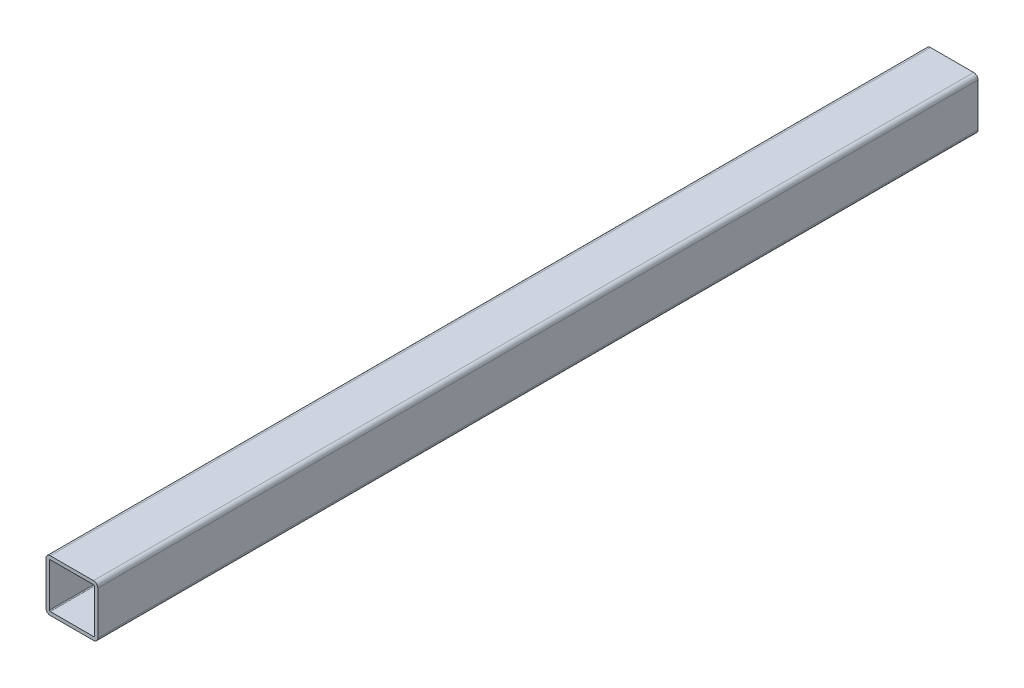
ISO-10303-21;
HEADER;
FILE_DESCRIPTION(('STEP AP214'),'2;1');
FILE_NAME('part.step','',(''),(''),'','','');
FILE_SCHEMA(('AUTOMOTIVE_DESIGN { 1 0 10303 214 1 1 1 1 }'));
ENDSEC;
DATA;
#1=APPLICATION_CONTEXT('core data for automotive mechanical design processes');
#2=APPLICATION_PROTOCOL_DEFINITION('international standard','automotive_design',2000,#1);
#3=PRODUCT_CONTEXT('',#1,'mechanical');
#4=PRODUCT('Part','Part','',(#3));
#5=PRODUCT_RELATED_PRODUCT_CATEGORY('part','',(#4));
#6=PRODUCT_DEFINITION_FORMATION('','',#4);
#7=PRODUCT_DEFINITION_CONTEXT('part definition',#1,'design');
#8=PRODUCT_DEFINITION('design','',#6,#7);
#9=PRODUCT_DEFINITION_SHAPE('','',#8);
#10=(LENGTH_UNIT() NAMED_UNIT(*) SI_UNIT(.MILLI.,.METRE.));
#11=(NAMED_UNIT(*) PLANE_ANGLE_UNIT() SI_UNIT($,.RADIAN.));
#12=(NAMED_UNIT(*) SI_UNIT($,.STERADIAN.) SOLID_ANGLE_UNIT());
#13=UNCERTAINTY_MEASURE_WITH_UNIT(LENGTH_MEASURE(1.E-05),#10,'distance_accuracy_value','');
#14=(GEOMETRIC_REPRESENTATION_CONTEXT(3) GLOBAL_UNCERTAINTY_ASSIGNED_CONTEXT((#13)) GLOBAL_UNIT_ASSIGNED_CONTEXT((#10,
#11,#12)) REPRESENTATION_CONTEXT('',''));
#15=CARTESIAN_POINT('',(0.,0.,0.));
#16=DIRECTION('',(0.,0.,1.));
#17=DIRECTION('',(1.,0.,0.));
#18=AXIS2_PLACEMENT_3D('',#15,#16,#17);
#19=CARTESIAN_POINT('',(-15.875,-15.875,323.85));
#20=DIRECTION('',(0.,0.,1.));
#21=DIRECTION('',(1.,0.,0.));
#22=AXIS2_PLACEMENT_3D('',#19,#20,#21);
#23=PLANE('',#22);
#24=CARTESIAN_POINT('',(-15.875,-15.875,323.85));
#25=DIRECTION('',(0.,0.,1.));
#26=DIRECTION('',(1.,0.,0.));
#27=AXIS2_PLACEMENT_3D('',#24,#25,#26);
#28=CIRCLE('',#27,3.175);
#29=CARTESIAN_POINT('',(-19.05,-15.875,323.85));
#30=VERTEX_POINT('',#29);
#31=CARTESIAN_POINT('',(-15.875,-19.05,323.85));
#32=VERTEX_POINT('',#31);
#33=EDGE_CURVE('E259',#30,#32,#28,.T.);
#34=ORIENTED_EDGE('',*,*,#33,.T.);
#35=DIRECTION('',(1.,0.,0.));
#36=VECTOR('',#35,1.);
#37=CARTESIAN_POINT('',(-15.875,-19.05,323.85));
#38=LINE('',#37,#36);
#39=CARTESIAN_POINT('',(15.875,-19.05,323.85));
#40=VERTEX_POINT('',#39);
#41=EDGE_CURVE('E262',#32,#40,#38,.T.);
#42=ORIENTED_EDGE('',*,*,#41,.T.);
#43=CARTESIAN_POINT('',(15.875,-15.875,323.85));
#44=DIRECTION('',(0.,0.,1.));
#45=DIRECTION('',(1.,0.,0.));
#46=AXIS2_PLACEMENT_3D('',#43,#44,#45);
#47=CIRCLE('',#46,3.175);
#48=CARTESIAN_POINT('',(19.05,-15.875,323.85));
#49=VERTEX_POINT('',#48);
#50=EDGE_CURVE('E265',#40,#49,#47,.T.);
#51=ORIENTED_EDGE('',*,*,#50,.T.);
#52=DIRECTION('',(0.,1.,0.));
#53=VECTOR('',#52,1.);
#54=CARTESIAN_POINT('',(19.05,15.875,323.85));
#55=LINE('',#54,#53);
#56=CARTESIAN_POINT('',(19.05,15.875,323.85));
#57=VERTEX_POINT('',#56);
#58=EDGE_CURVE('E267',#49,#57,#55,.T.);
#59=ORIENTED_EDGE('',*,*,#58,.T.);
#60=CARTESIAN_POINT('',(15.875,15.875,323.85));
#61=DIRECTION('',(0.,0.,1.));
#62=DIRECTION('',(1.,0.,0.));
#63=AXIS2_PLACEMENT_3D('',#60,#61,#62);
#64=CIRCLE('',#63,3.175);
#65=CARTESIAN_POINT('',(15.875,19.05,323.85));
#66=VERTEX_POINT('',#65);
#67=EDGE_CURVE('E269',#57,#66,#64,.T.);
#68=ORIENTED_EDGE('',*,*,#67,.T.);
#69=DIRECTION('',(-1.,0.,0.));
#70=VECTOR('',#69,1.);
#71=CARTESIAN_POINT('',(-15.875,19.05,323.85));
#72=LINE('',#71,#70);
#73=CARTESIAN_POINT('',(-15.875,19.05,323.85));
#74=VERTEX_POINT('',#73);
#75=EDGE_CURVE('E271',#66,#74,#72,.T.);
#76=ORIENTED_EDGE('',*,*,#75,.T.);
#77=CARTESIAN_POINT('',(-15.875,15.875,323.85));
#78=DIRECTION('',(0.,0.,1.));
#79=DIRECTION('',(1.,0.,0.));
#80=AXIS2_PLACEMENT_3D('',#77,#78,#79);
#81=CIRCLE('',#80,3.175);
#82=CARTESIAN_POINT('',(-19.05,15.875,323.85));
#83=VERTEX_POINT('',#82);
#84=EDGE_CURVE('E273',#74,#83,#81,.T.);
#85=ORIENTED_EDGE('',*,*,#84,.T.);
#86=DIRECTION('',(0.,-1.,0.));
#87=VECTOR('',#86,1.);
#88=CARTESIAN_POINT('',(-19.05,15.875,323.85));
#89=LINE('',#88,#87);
#90=EDGE_CURVE('E275',#83,#30,#89,.T.);
#91=ORIENTED_EDGE('',*,*,#90,.T.);
#92=EDGE_LOOP('',(#34,#42,#51,#59,#68,#76,#85,#91));
#93=FACE_BOUND('',#92,.T.);
#94=DIRECTION('',(1.,0.,0.));
#95=VECTOR('',#94,1.);
#96=CARTESIAN_POINT('',(-15.875,-16.51,323.85));
#97=LINE('',#96,#95);
#98=CARTESIAN_POINT('',(-15.875,-16.51,323.85));
#99=VERTEX_POINT('',#98);
#100=CARTESIAN_POINT('',(15.875,-16.51,323.85));
#101=VERTEX_POINT('',#100);
#102=EDGE_CURVE('E202',#99,#101,#97,.T.);
#103=ORIENTED_EDGE('',*,*,#102,.F.);
#104=CARTESIAN_POINT('',(-15.875,-15.875,323.85));
#105=DIRECTION('',(0.,0.,1.));
#106=DIRECTION('',(1.,0.,0.));
#107=AXIS2_PLACEMENT_3D('',#104,#105,#106);
#108=CIRCLE('',#107,0.635000000000002);
#109=CARTESIAN_POINT('',(-16.51,-15.875,323.85));
#110=VERTEX_POINT('',#109);
#111=EDGE_CURVE('E194',#110,#99,#108,.T.);
#112=ORIENTED_EDGE('',*,*,#111,.F.);
#113=DIRECTION('',(0.,-1.,0.));
#114=VECTOR('',#113,1.);
#115=CARTESIAN_POINT('',(-16.51,15.875,323.85));
#116=LINE('',#115,#114);
#117=CARTESIAN_POINT('',(-16.51,15.875,323.85));
#118=VERTEX_POINT('',#117);
#119=EDGE_CURVE('E227',#118,#110,#116,.T.);
#120=ORIENTED_EDGE('',*,*,#119,.F.);
#121=CARTESIAN_POINT('',(-15.875,15.875,323.85));
#122=DIRECTION('',(0.,0.,1.));
#123=DIRECTION('',(1.,0.,0.));
#124=AXIS2_PLACEMENT_3D('',#121,#122,#123);
#125=CIRCLE('',#124,0.635000000000004);
#126=CARTESIAN_POINT('',(-15.875,16.51,323.85));
#127=VERTEX_POINT('',#126);
#128=EDGE_CURVE('E225',#127,#118,#125,.T.);
#129=ORIENTED_EDGE('',*,*,#128,.F.);
#130=DIRECTION('',(-1.,0.,0.));
#131=VECTOR('',#130,1.);
#132=CARTESIAN_POINT('',(-15.875,16.51,323.85));
#133=LINE('',#132,#131);
#134=CARTESIAN_POINT('',(15.875,16.51,323.85));
#135=VERTEX_POINT('',#134);
#136=EDGE_CURVE('E223',#135,#127,#133,.T.);
#137=ORIENTED_EDGE('',*,*,#136,.F.);
#138=CARTESIAN_POINT('',(15.875,15.875,323.85));
#139=DIRECTION('',(0.,0.,1.));
#140=DIRECTION('',(1.,0.,0.));
#141=AXIS2_PLACEMENT_3D('',#138,#139,#140);
#142=CIRCLE('',#141,0.635000000000004);
#143=CARTESIAN_POINT('',(16.51,15.875,323.85));
#144=VERTEX_POINT('',#143);
#145=EDGE_CURVE('E221',#144,#135,#142,.T.);
#146=ORIENTED_EDGE('',*,*,#145,.F.);
#147=DIRECTION('',(0.,1.,0.));
#148=VECTOR('',#147,1.);
#149=CARTESIAN_POINT('',(16.51,15.875,323.85));
#150=LINE('',#149,#148);
#151=CARTESIAN_POINT('',(16.51,-15.875,323.85));
#152=VERTEX_POINT('',#151);
#153=EDGE_CURVE('E217',#152,#144,#150,.T.);
#154=ORIENTED_EDGE('',*,*,#153,.F.);
#155=CARTESIAN_POINT('',(15.875,-15.875,323.85));
#156=DIRECTION('',(0.,0.,1.));
#157=DIRECTION('',(1.,0.,0.));
#158=AXIS2_PLACEMENT_3D('',#155,#156,#157);
#159=CIRCLE('',#158,0.634999999999999);
#160=EDGE_CURVE('E215',#101,#152,#159,.T.);
#161=ORIENTED_EDGE('',*,*,#160,.F.);
#162=EDGE_LOOP('',(#103,#112,#120,#129,#137,#146,#154,#161));
#163=FACE_BOUND('',#162,.T.);
#164=ADVANCED_FACE('F81',(#93,#163),#23,.T.);
#165=CARTESIAN_POINT('',(-15.875,-15.875,-323.85));
#166=DIRECTION('',(0.,0.,1.));
#167=DIRECTION('',(1.,0.,0.));
#168=AXIS2_PLACEMENT_3D('',#165,#166,#167);
#169=PLANE('',#168);
#170=CARTESIAN_POINT('',(-15.875,-15.875,-323.85));
#171=DIRECTION('',(0.,0.,1.));
#172=DIRECTION('',(1.,0.,0.));
#173=AXIS2_PLACEMENT_3D('',#170,#171,#172);
#174=CIRCLE('',#173,3.175);
#175=CARTESIAN_POINT('',(-19.05,-15.875,-323.85));
#176=VERTEX_POINT('',#175);
#177=CARTESIAN_POINT('',(-15.875,-19.05,-323.85));
#178=VERTEX_POINT('',#177);
#179=EDGE_CURVE('E210',#176,#178,#174,.T.);
#180=ORIENTED_EDGE('',*,*,#179,.F.);
#181=DIRECTION('',(0.,-1.,0.));
#182=VECTOR('',#181,1.);
#183=CARTESIAN_POINT('',(-19.05,15.875,-323.85));
#184=LINE('',#183,#182);
#185=CARTESIAN_POINT('',(-19.05,15.875,-323.85));
#186=VERTEX_POINT('',#185);
#187=EDGE_CURVE('E263',#186,#176,#184,.T.);
#188=ORIENTED_EDGE('',*,*,#187,.F.);
#189=CARTESIAN_POINT('',(-15.875,15.875,-323.85));
#190=DIRECTION('',(0.,0.,1.));
#191=DIRECTION('',(1.,0.,0.));
#192=AXIS2_PLACEMENT_3D('',#189,#190,#191);
#193=CIRCLE('',#192,3.175);
#194=CARTESIAN_POINT('',(-15.875,19.05,-323.85));
#195=VERTEX_POINT('',#194);
#196=EDGE_CURVE('E290',#195,#186,#193,.T.);
#197=ORIENTED_EDGE('',*,*,#196,.F.);
#198=DIRECTION('',(-1.,0.,0.));
#199=VECTOR('',#198,1.);
#200=CARTESIAN_POINT('',(-15.875,19.05,-323.85));
#201=LINE('',#200,#199);
#202=CARTESIAN_POINT('',(15.875,19.05,-323.85));
#203=VERTEX_POINT('',#202);
#204=EDGE_CURVE('E288',#203,#195,#201,.T.);
#205=ORIENTED_EDGE('',*,*,#204,.F.);
#206=CARTESIAN_POINT('',(15.875,15.875,-323.85));
#207=DIRECTION('',(0.,0.,1.));
#208=DIRECTION('',(1.,0.,0.));
#209=AXIS2_PLACEMENT_3D('',#206,#207,#208);
#210=CIRCLE('',#209,3.175);
#211=CARTESIAN_POINT('',(19.05,15.875,-323.85));
#212=VERTEX_POINT('',#211);
#213=EDGE_CURVE('E286',#212,#203,#210,.T.);
#214=ORIENTED_EDGE('',*,*,#213,.F.);
#215=DIRECTION('',(0.,1.,0.));
#216=VECTOR('',#215,1.);
#217=CARTESIAN_POINT('',(19.05,15.875,-323.85));
#218=LINE('',#217,#216);
#219=CARTESIAN_POINT('',(19.05,-15.875,-323.85));
#220=VERTEX_POINT('',#219);
#221=EDGE_CURVE('E284',#220,#212,#218,.T.);
#222=ORIENTED_EDGE('',*,*,#221,.F.);
#223=CARTESIAN_POINT('',(15.875,-15.875,-323.85));
#224=DIRECTION('',(0.,0.,1.));
#225=DIRECTION('',(1.,0.,0.));
#226=AXIS2_PLACEMENT_3D('',#223,#224,#225);
#227=CIRCLE('',#226,3.175);
#228=CARTESIAN_POINT('',(15.875,-19.05,-323.85));
#229=VERTEX_POINT('',#228);
#230=EDGE_CURVE('E282',#229,#220,#227,.T.);
#231=ORIENTED_EDGE('',*,*,#230,.F.);
#232=DIRECTION('',(1.,0.,0.));
#233=VECTOR('',#232,1.);
#234=CARTESIAN_POINT('',(-15.875,-19.05,-323.85));
#235=LINE('',#234,#233);
#236=EDGE_CURVE('E280',#178,#229,#235,.T.);
#237=ORIENTED_EDGE('',*,*,#236,.F.);
#238=EDGE_LOOP('',(#180,#188,#197,#205,#214,#222,#231,#237));
#239=FACE_BOUND('',#238,.T.);
#240=CARTESIAN_POINT('',(-15.875,-15.875,-323.85));
#241=DIRECTION('',(0.,0.,1.));
#242=DIRECTION('',(1.,0.,0.));
#243=AXIS2_PLACEMENT_3D('',#240,#241,#242);
#244=CIRCLE('',#243,0.635000000000002);
#245=CARTESIAN_POINT('',(-16.51,-15.875,-323.85));
#246=VERTEX_POINT('',#245);
#247=CARTESIAN_POINT('',(-15.875,-16.51,-323.85));
#248=VERTEX_POINT('',#247);
#249=EDGE_CURVE('E104',#246,#248,#244,.T.);
#250=ORIENTED_EDGE('',*,*,#249,.T.);
#251=DIRECTION('',(1.,0.,0.));
#252=VECTOR('',#251,1.);
#253=CARTESIAN_POINT('',(-15.875,-16.51,-323.85));
#254=LINE('',#253,#252);
#255=CARTESIAN_POINT('',(15.875,-16.51,-323.85));
#256=VERTEX_POINT('',#255);
#257=EDGE_CURVE('E209',#248,#256,#254,.T.);
#258=ORIENTED_EDGE('',*,*,#257,.T.);
#259=CARTESIAN_POINT('',(15.875,-15.875,-323.85));
#260=DIRECTION('',(0.,0.,1.));
#261=DIRECTION('',(1.,0.,0.));
#262=AXIS2_PLACEMENT_3D('',#259,#260,#261);
#263=CIRCLE('',#262,0.634999999999999);
#264=CARTESIAN_POINT('',(16.51,-15.875,-323.85));
#265=VERTEX_POINT('',#264);
#266=EDGE_CURVE('E231',#256,#265,#263,.T.);
#267=ORIENTED_EDGE('',*,*,#266,.T.);
#268=DIRECTION('',(0.,1.,0.));
#269=VECTOR('',#268,1.);
#270=CARTESIAN_POINT('',(16.51,15.875,-323.85));
#271=LINE('',#270,#269);
#272=CARTESIAN_POINT('',(16.51,15.875,-323.85));
#273=VERTEX_POINT('',#272);
#274=EDGE_CURVE('E234',#265,#273,#271,.T.);
#275=ORIENTED_EDGE('',*,*,#274,.T.);
#276=CARTESIAN_POINT('',(15.875,15.875,-323.85));
#277=DIRECTION('',(0.,0.,1.));
#278=DIRECTION('',(1.,0.,0.));
#279=AXIS2_PLACEMENT_3D('',#276,#277,#278);
#280=CIRCLE('',#279,0.635000000000004);
#281=CARTESIAN_POINT('',(15.875,16.51,-323.85));
#282=VERTEX_POINT('',#281);
#283=EDGE_CURVE('E237',#273,#282,#280,.T.);
#284=ORIENTED_EDGE('',*,*,#283,.T.);
#285=DIRECTION('',(-1.,0.,0.));
#286=VECTOR('',#285,1.);
#287=CARTESIAN_POINT('',(-15.875,16.51,-323.85));
#288=LINE('',#287,#286);
#289=CARTESIAN_POINT('',(-15.875,16.51,-323.85));
#290=VERTEX_POINT('',#289);
#291=EDGE_CURVE('E240',#282,#290,#288,.T.);
#292=ORIENTED_EDGE('',*,*,#291,.T.);
#293=CARTESIAN_POINT('',(-15.875,15.875,-323.85));
#294=DIRECTION('',(0.,0.,1.));
#295=DIRECTION('',(1.,0.,0.));
#296=AXIS2_PLACEMENT_3D('',#293,#294,#295);
#297=CIRCLE('',#296,0.635000000000004);
#298=CARTESIAN_POINT('',(-16.51,15.875,-323.85));
#299=VERTEX_POINT('',#298);
#300=EDGE_CURVE('E243',#290,#299,#297,.T.);
#301=ORIENTED_EDGE('',*,*,#300,.T.);
#302=DIRECTION('',(0.,-1.,0.));
#303=VECTOR('',#302,1.);
#304=CARTESIAN_POINT('',(-16.51,15.875,-323.85));
#305=LINE('',#304,#303);
#306=EDGE_CURVE('E203',#299,#246,#305,.T.);
#307=ORIENTED_EDGE('',*,*,#306,.T.);
#308=EDGE_LOOP('',(#250,#258,#267,#275,#284,#292,#301,#307));
#309=FACE_BOUND('',#308,.T.);
#310=ADVANCED_FACE('F320',(#239,#309),#169,.F.);
#311=CARTESIAN_POINT('',(-15.875,-15.875,323.85));
#312=DIRECTION('',(0.,0.,-1.));
#313=DIRECTION('',(-1.,0.,0.));
#314=AXIS2_PLACEMENT_3D('',#311,#312,#313);
#315=CYLINDRICAL_SURFACE('',#314,3.175);
#316=ORIENTED_EDGE('',*,*,#179,.T.);
#317=DIRECTION('',(0.,0.,-1.));
#318=VECTOR('',#317,1.);
#319=CARTESIAN_POINT('',(-15.875,-19.05,323.85));
#320=LINE('',#319,#318);
#321=EDGE_CURVE('E12',#32,#178,#320,.T.);
#322=ORIENTED_EDGE('',*,*,#321,.F.);
#323=ORIENTED_EDGE('',*,*,#33,.F.);
#324=DIRECTION('',(0.,0.,-1.));
#325=VECTOR('',#324,1.);
#326=CARTESIAN_POINT('',(-19.05,-15.875,323.85));
#327=LINE('',#326,#325);
#328=EDGE_CURVE('E277',#30,#176,#327,.T.);
#329=ORIENTED_EDGE('',*,*,#328,.T.);
#330=EDGE_LOOP('',(#316,#322,#323,#329));
#331=FACE_BOUND('',#330,.T.);
#332=ADVANCED_FACE('F83',(#331),#315,.T.);
#333=CARTESIAN_POINT('',(-15.875,-19.05,323.85));
#334=DIRECTION('',(0.,1.,0.));
#335=DIRECTION('',(0.,0.,1.));
#336=AXIS2_PLACEMENT_3D('',#333,#334,#335);
#337=PLANE('',#336);
#338=ORIENTED_EDGE('',*,*,#236,.T.);
#339=DIRECTION('',(0.,0.,-1.));
#340=VECTOR('',#339,1.);
#341=CARTESIAN_POINT('',(15.875,-19.05,323.85));
#342=LINE('',#341,#340);
#343=EDGE_CURVE('E89',#40,#229,#342,.T.);
#344=ORIENTED_EDGE('',*,*,#343,.F.);
#345=ORIENTED_EDGE('',*,*,#41,.F.);
#346=ORIENTED_EDGE('',*,*,#321,.T.);
#347=EDGE_LOOP('',(#338,#344,#345,#346));
#348=FACE_BOUND('',#347,.T.);
#349=ADVANCED_FACE('F337',(#348),#337,.F.);
#350=CARTESIAN_POINT('',(15.875,-15.875,323.85));
#351=DIRECTION('',(0.,0.,-1.));
#352=DIRECTION('',(-1.,0.,0.));
#353=AXIS2_PLACEMENT_3D('',#350,#351,#352);
#354=CYLINDRICAL_SURFACE('',#353,3.175);
#355=ORIENTED_EDGE('',*,*,#230,.T.);
#356=DIRECTION('',(0.,0.,-1.));
#357=VECTOR('',#356,1.);
#358=CARTESIAN_POINT('',(19.05,-15.875,323.85));
#359=LINE('',#358,#357);
#360=EDGE_CURVE('E307',#49,#220,#359,.T.);
#361=ORIENTED_EDGE('',*,*,#360,.F.);
#362=ORIENTED_EDGE('',*,*,#50,.F.);
#363=ORIENTED_EDGE('',*,*,#343,.T.);
#364=EDGE_LOOP('',(#355,#361,#362,#363));
#365=FACE_BOUND('',#364,.T.);
#366=ADVANCED_FACE('F314',(#365),#354,.T.);
#367=CARTESIAN_POINT('',(19.05,15.875,323.85));
#368=DIRECTION('',(-1.,0.,0.));
#369=DIRECTION('',(0.,-1.,0.));
#370=AXIS2_PLACEMENT_3D('',#367,#368,#369);
#371=PLANE('',#370);
#372=ORIENTED_EDGE('',*,*,#221,.T.);
#373=DIRECTION('',(0.,0.,-1.));
#374=VECTOR('',#373,1.);
#375=CARTESIAN_POINT('',(19.05,15.875,323.85));
#376=LINE('',#375,#374);
#377=EDGE_CURVE('E304',#57,#212,#376,.T.);
#378=ORIENTED_EDGE('',*,*,#377,.F.);
#379=ORIENTED_EDGE('',*,*,#58,.F.);
#380=ORIENTED_EDGE('',*,*,#360,.T.);
#381=EDGE_LOOP('',(#372,#378,#379,#380));
#382=FACE_BOUND('',#381,.T.);
#383=ADVANCED_FACE('F326',(#382),#371,.F.);
#384=CARTESIAN_POINT('',(15.875,15.875,323.85));
#385=DIRECTION('',(0.,0.,-1.));
#386=DIRECTION('',(-1.,0.,0.));
#387=AXIS2_PLACEMENT_3D('',#384,#385,#386);
#388=CYLINDRICAL_SURFACE('',#387,3.175);
#389=ORIENTED_EDGE('',*,*,#213,.T.);
#390=DIRECTION('',(0.,0.,-1.));
#391=VECTOR('',#390,1.);
#392=CARTESIAN_POINT('',(15.875,19.05,323.85));
#393=LINE('',#392,#391);
#394=EDGE_CURVE('E301',#66,#203,#393,.T.);
#395=ORIENTED_EDGE('',*,*,#394,.F.);
#396=ORIENTED_EDGE('',*,*,#67,.F.);
#397=ORIENTED_EDGE('',*,*,#377,.T.);
#398=EDGE_LOOP('',(#389,#395,#396,#397));
#399=FACE_BOUND('',#398,.T.);
#400=ADVANCED_FACE('F330',(#399),#388,.T.);
#401=CARTESIAN_POINT('',(-15.875,19.05,323.85));
#402=DIRECTION('',(0.,-1.,0.));
#403=DIRECTION('',(0.,0.,-1.));
#404=AXIS2_PLACEMENT_3D('',#401,#402,#403);
#405=PLANE('',#404);
#406=ORIENTED_EDGE('',*,*,#204,.T.);
#407=DIRECTION('',(0.,0.,-1.));
#408=VECTOR('',#407,1.);
#409=CARTESIAN_POINT('',(-15.875,19.05,323.85));
#410=LINE('',#409,#408);
#411=EDGE_CURVE('E298',#74,#195,#410,.T.);
#412=ORIENTED_EDGE('',*,*,#411,.F.);
#413=ORIENTED_EDGE('',*,*,#75,.F.);
#414=ORIENTED_EDGE('',*,*,#394,.T.);
#415=EDGE_LOOP('',(#406,#412,#413,#414));
#416=FACE_BOUND('',#415,.T.);
#417=ADVANCED_FACE('F350',(#416),#405,.F.);
#418=CARTESIAN_POINT('',(-15.875,15.875,323.85));
#419=DIRECTION('',(0.,0.,-1.));
#420=DIRECTION('',(-1.,0.,0.));
#421=AXIS2_PLACEMENT_3D('',#418,#419,#420);
#422=CYLINDRICAL_SURFACE('',#421,3.175);
#423=ORIENTED_EDGE('',*,*,#196,.T.);
#424=DIRECTION('',(0.,0.,-1.));
#425=VECTOR('',#424,1.);
#426=CARTESIAN_POINT('',(-19.05,15.875,323.85));
#427=LINE('',#426,#425);
#428=EDGE_CURVE('E295',#83,#186,#427,.T.);
#429=ORIENTED_EDGE('',*,*,#428,.F.);
#430=ORIENTED_EDGE('',*,*,#84,.F.);
#431=ORIENTED_EDGE('',*,*,#411,.T.);
#432=EDGE_LOOP('',(#423,#429,#430,#431));
#433=FACE_BOUND('',#432,.T.);
#434=ADVANCED_FACE('F348',(#433),#422,.T.);
#435=CARTESIAN_POINT('',(-19.05,15.875,323.85));
#436=DIRECTION('',(1.,0.,0.));
#437=DIRECTION('',(0.,1.,0.));
#438=AXIS2_PLACEMENT_3D('',#435,#436,#437);
#439=PLANE('',#438);
#440=ORIENTED_EDGE('',*,*,#187,.T.);
#441=ORIENTED_EDGE('',*,*,#328,.F.);
#442=ORIENTED_EDGE('',*,*,#90,.F.);
#443=ORIENTED_EDGE('',*,*,#428,.T.);
#444=EDGE_LOOP('',(#440,#441,#442,#443));
#445=FACE_BOUND('',#444,.T.);
#446=ADVANCED_FACE('F343',(#445),#439,.F.);
#447=CARTESIAN_POINT('',(-15.875,-15.875,323.85));
#448=DIRECTION('',(0.,0.,-1.));
#449=DIRECTION('',(-1.,0.,0.));
#450=AXIS2_PLACEMENT_3D('',#447,#448,#449);
#451=CYLINDRICAL_SURFACE('',#450,0.635000000000002);
#452=ORIENTED_EDGE('',*,*,#249,.F.);
#453=DIRECTION('',(0.,0.,-1.));
#454=VECTOR('',#453,1.);
#455=CARTESIAN_POINT('',(-16.51,-15.875,323.85));
#456=LINE('',#455,#454);
#457=EDGE_CURVE('E198',#110,#246,#456,.T.);
#458=ORIENTED_EDGE('',*,*,#457,.F.);
#459=ORIENTED_EDGE('',*,*,#111,.T.);
#460=DIRECTION('',(0.,0.,-1.));
#461=VECTOR('',#460,1.);
#462=CARTESIAN_POINT('',(-15.875,-16.51,323.85));
#463=LINE('',#462,#461);
#464=EDGE_CURVE('E197',#99,#248,#463,.T.);
#465=ORIENTED_EDGE('',*,*,#464,.T.);
#466=EDGE_LOOP('',(#452,#458,#459,#465));
#467=FACE_BOUND('',#466,.T.);
#468=ADVANCED_FACE('F196',(#467),#451,.F.);
#469=CARTESIAN_POINT('',(-15.875,-16.51,323.85));
#470=DIRECTION('',(0.,1.,0.));
#471=DIRECTION('',(0.,0.,1.));
#472=AXIS2_PLACEMENT_3D('',#469,#470,#471);
#473=PLANE('',#472);
#474=ORIENTED_EDGE('',*,*,#257,.F.);
#475=ORIENTED_EDGE('',*,*,#464,.F.);
#476=ORIENTED_EDGE('',*,*,#102,.T.);
#477=DIRECTION('',(0.,0.,-1.));
#478=VECTOR('',#477,1.);
#479=CARTESIAN_POINT('',(15.875,-16.51,323.85));
#480=LINE('',#479,#478);
#481=EDGE_CURVE('E211',#101,#256,#480,.T.);
#482=ORIENTED_EDGE('',*,*,#481,.T.);
#483=EDGE_LOOP('',(#474,#475,#476,#482));
#484=FACE_BOUND('',#483,.T.);
#485=ADVANCED_FACE('F206',(#484),#473,.T.);
#486=CARTESIAN_POINT('',(15.875,-15.875,323.85));
#487=DIRECTION('',(0.,0.,-1.));
#488=DIRECTION('',(-1.,0.,0.));
#489=AXIS2_PLACEMENT_3D('',#486,#487,#488);
#490=CYLINDRICAL_SURFACE('',#489,0.634999999999999);
#491=ORIENTED_EDGE('',*,*,#266,.F.);
#492=ORIENTED_EDGE('',*,*,#481,.F.);
#493=ORIENTED_EDGE('',*,*,#160,.T.);
#494=DIRECTION('',(0.,0.,-1.));
#495=VECTOR('',#494,1.);
#496=CARTESIAN_POINT('',(16.51,-15.875,323.85));
#497=LINE('',#496,#495);
#498=EDGE_CURVE('E256',#152,#265,#497,.T.);
#499=ORIENTED_EDGE('',*,*,#498,.T.);
#500=EDGE_LOOP('',(#491,#492,#493,#499));
#501=FACE_BOUND('',#500,.T.);
#502=ADVANCED_FACE('F375',(#501),#490,.F.);
#503=CARTESIAN_POINT('',(16.51,15.875,323.85));
#504=DIRECTION('',(-1.,0.,0.));
#505=DIRECTION('',(0.,-1.,0.));
#506=AXIS2_PLACEMENT_3D('',#503,#504,#505);
#507=PLANE('',#506);
#508=ORIENTED_EDGE('',*,*,#274,.F.);
#509=ORIENTED_EDGE('',*,*,#498,.F.);
#510=ORIENTED_EDGE('',*,*,#153,.T.);
#511=DIRECTION('',(0.,0.,-1.));
#512=VECTOR('',#511,1.);
#513=CARTESIAN_POINT('',(16.51,15.875,323.85));
#514=LINE('',#513,#512);
#515=EDGE_CURVE('E254',#144,#273,#514,.T.);
#516=ORIENTED_EDGE('',*,*,#515,.T.);
#517=EDGE_LOOP('',(#508,#509,#510,#516));
#518=FACE_BOUND('',#517,.T.);
#519=ADVANCED_FACE('F379',(#518),#507,.T.);
#520=CARTESIAN_POINT('',(15.875,15.875,323.85));
#521=DIRECTION('',(0.,0.,-1.));
#522=DIRECTION('',(-1.,0.,0.));
#523=AXIS2_PLACEMENT_3D('',#520,#521,#522);
#524=CYLINDRICAL_SURFACE('',#523,0.635000000000004);
#525=ORIENTED_EDGE('',*,*,#283,.F.);
#526=ORIENTED_EDGE('',*,*,#515,.F.);
#527=ORIENTED_EDGE('',*,*,#145,.T.);
#528=DIRECTION('',(0.,0.,-1.));
#529=VECTOR('',#528,1.);
#530=CARTESIAN_POINT('',(15.875,16.51,323.85));
#531=LINE('',#530,#529);
#532=EDGE_CURVE('E252',#135,#282,#531,.T.);
#533=ORIENTED_EDGE('',*,*,#532,.T.);
#534=EDGE_LOOP('',(#525,#526,#527,#533));
#535=FACE_BOUND('',#534,.T.);
#536=ADVANCED_FACE('F385',(#535),#524,.F.);
#537=CARTESIAN_POINT('',(-15.875,16.51,323.85));
#538=DIRECTION('',(0.,-1.,0.));
#539=DIRECTION('',(0.,0.,-1.));
#540=AXIS2_PLACEMENT_3D('',#537,#538,#539);
#541=PLANE('',#540);
#542=ORIENTED_EDGE('',*,*,#291,.F.);
#543=ORIENTED_EDGE('',*,*,#532,.F.);
#544=ORIENTED_EDGE('',*,*,#136,.T.);
#545=DIRECTION('',(0.,0.,-1.));
#546=VECTOR('',#545,1.);
#547=CARTESIAN_POINT('',(-15.875,16.51,323.85));
#548=LINE('',#547,#546);
#549=EDGE_CURVE('E250',#127,#290,#548,.T.);
#550=ORIENTED_EDGE('',*,*,#549,.T.);
#551=EDGE_LOOP('',(#542,#543,#544,#550));
#552=FACE_BOUND('',#551,.T.);
#553=ADVANCED_FACE('F389',(#552),#541,.T.);
#554=CARTESIAN_POINT('',(-15.875,15.875,323.85));
#555=DIRECTION('',(0.,0.,-1.));
#556=DIRECTION('',(-1.,0.,0.));
#557=AXIS2_PLACEMENT_3D('',#554,#555,#556);
#558=CYLINDRICAL_SURFACE('',#557,0.635000000000004);
#559=ORIENTED_EDGE('',*,*,#300,.F.);
#560=ORIENTED_EDGE('',*,*,#549,.F.);
#561=ORIENTED_EDGE('',*,*,#128,.T.);
#562=DIRECTION('',(0.,0.,-1.));
#563=VECTOR('',#562,1.);
#564=CARTESIAN_POINT('',(-16.51,15.875,323.85));
#565=LINE('',#564,#563);
#566=EDGE_CURVE('E96',#118,#299,#565,.T.);
#567=ORIENTED_EDGE('',*,*,#566,.T.);
#568=EDGE_LOOP('',(#559,#560,#561,#567));
#569=FACE_BOUND('',#568,.T.);
#570=ADVANCED_FACE('F393',(#569),#558,.F.);
#571=CARTESIAN_POINT('',(-16.51,15.875,323.85));
#572=DIRECTION('',(1.,0.,0.));
#573=DIRECTION('',(0.,1.,0.));
#574=AXIS2_PLACEMENT_3D('',#571,#572,#573);
#575=PLANE('',#574);
#576=ORIENTED_EDGE('',*,*,#306,.F.);
#577=ORIENTED_EDGE('',*,*,#566,.F.);
#578=ORIENTED_EDGE('',*,*,#119,.T.);
#579=ORIENTED_EDGE('',*,*,#457,.T.);
#580=EDGE_LOOP('',(#576,#577,#578,#579));
#581=FACE_BOUND('',#580,.T.);
#582=ADVANCED_FACE('F397',(#581),#575,.T.);
#583=CLOSED_SHELL('',(#164,#310,#332,#349,#366,#383,#400,#417,#434,#446,#468,#485,#502,#519,
#536,#553,#570,#582));
#584=MANIFOLD_SOLID_BREP('B2',#583);
#585=ADVANCED_BREP_SHAPE_REPRESENTATION('',(#18,#584),#14);
#586=SHAPE_DEFINITION_REPRESENTATION(#9,#585);
ENDSEC;
END-ISO-10303-21;
